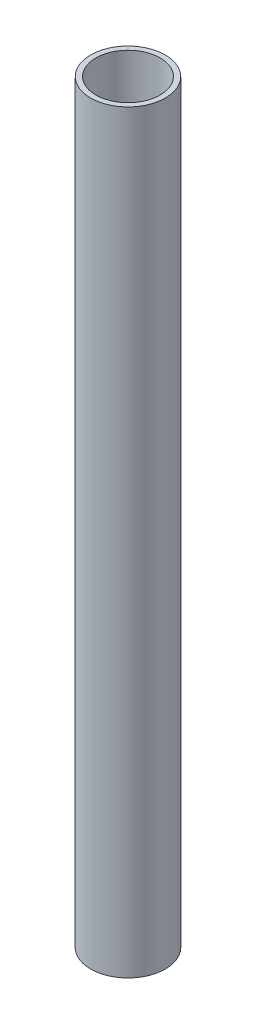
ISO-10303-21;
HEADER;
FILE_DESCRIPTION(('STEP AP214'),'2;1');
FILE_NAME('part.step','',(''),(''),'','','');
FILE_SCHEMA(('AUTOMOTIVE_DESIGN { 1 0 10303 214 1 1 1 1 }'));
ENDSEC;
DATA;
#1=APPLICATION_CONTEXT('core data for automotive mechanical design processes');
#2=APPLICATION_PROTOCOL_DEFINITION('international standard','automotive_design',2000,#1);
#3=PRODUCT_CONTEXT('',#1,'mechanical');
#4=PRODUCT('Part','Part','',(#3));
#5=PRODUCT_RELATED_PRODUCT_CATEGORY('part','',(#4));
#6=PRODUCT_DEFINITION_FORMATION('','',#4);
#7=PRODUCT_DEFINITION_CONTEXT('part definition',#1,'design');
#8=PRODUCT_DEFINITION('design','',#6,#7);
#9=PRODUCT_DEFINITION_SHAPE('','',#8);
#10=(LENGTH_UNIT() NAMED_UNIT(*) SI_UNIT(.MILLI.,.METRE.));
#11=(NAMED_UNIT(*) PLANE_ANGLE_UNIT() SI_UNIT($,.RADIAN.));
#12=(NAMED_UNIT(*) SI_UNIT($,.STERADIAN.) SOLID_ANGLE_UNIT());
#13=UNCERTAINTY_MEASURE_WITH_UNIT(LENGTH_MEASURE(1.E-05),#10,'distance_accuracy_value','');
#14=(GEOMETRIC_REPRESENTATION_CONTEXT(3) GLOBAL_UNCERTAINTY_ASSIGNED_CONTEXT((#13)) GLOBAL_UNIT_ASSIGNED_CONTEXT((#10,
#11,#12)) REPRESENTATION_CONTEXT('',''));
#15=CARTESIAN_POINT('',(0.,0.,0.));
#16=DIRECTION('',(0.,0.,1.));
#17=DIRECTION('',(1.,0.,0.));
#18=AXIS2_PLACEMENT_3D('',#15,#16,#17);
#19=CARTESIAN_POINT('',(0.,609.6,0.));
#20=DIRECTION('',(0.,1.,0.));
#21=DIRECTION('',(0.,0.,1.));
#22=AXIS2_PLACEMENT_3D('',#19,#20,#21);
#23=PLANE('',#22);
#24=CARTESIAN_POINT('',(0.,609.6,0.));
#25=DIRECTION('',(0.,1.,0.));
#26=DIRECTION('',(0.,0.,1.));
#27=AXIS2_PLACEMENT_3D('',#24,#25,#26);
#28=CIRCLE('',#27,30.1625);
#29=CARTESIAN_POINT('',(0.,609.6,30.1625));
#30=VERTEX_POINT('',#29);
#31=EDGE_CURVE('E10',#30,#30,#28,.T.);
#32=ORIENTED_EDGE('',*,*,#31,.T.);
#33=EDGE_LOOP('',(#32));
#34=FACE_BOUND('',#33,.T.);
#35=CARTESIAN_POINT('',(0.,609.6,0.));
#36=DIRECTION('',(0.,1.,0.));
#37=DIRECTION('',(0.,0.,1.));
#38=AXIS2_PLACEMENT_3D('',#35,#36,#37);
#39=CIRCLE('',#38,25.9969);
#40=CARTESIAN_POINT('',(0.,609.6,25.9969));
#41=VERTEX_POINT('',#40);
#42=EDGE_CURVE('E43',#41,#41,#39,.T.);
#43=ORIENTED_EDGE('',*,*,#42,.F.);
#44=EDGE_LOOP('',(#43));
#45=FACE_BOUND('',#44,.T.);
#46=ADVANCED_FACE('F32',(#34,#45),#23,.T.);
#47=CARTESIAN_POINT('',(0.,0.,0.));
#48=DIRECTION('',(0.,1.,0.));
#49=DIRECTION('',(0.,0.,1.));
#50=AXIS2_PLACEMENT_3D('',#47,#48,#49);
#51=PLANE('',#50);
#52=CARTESIAN_POINT('',(0.,0.,0.));
#53=DIRECTION('',(0.,1.,0.));
#54=DIRECTION('',(0.,0.,1.));
#55=AXIS2_PLACEMENT_3D('',#52,#53,#54);
#56=CIRCLE('',#55,30.1625);
#57=CARTESIAN_POINT('',(0.,0.,30.1625));
#58=VERTEX_POINT('',#57);
#59=EDGE_CURVE('E36',#58,#58,#56,.T.);
#60=ORIENTED_EDGE('',*,*,#59,.F.);
#61=EDGE_LOOP('',(#60));
#62=FACE_BOUND('',#61,.T.);
#63=CARTESIAN_POINT('',(0.,0.,0.));
#64=DIRECTION('',(0.,1.,0.));
#65=DIRECTION('',(0.,0.,1.));
#66=AXIS2_PLACEMENT_3D('',#63,#64,#65);
#67=CIRCLE('',#66,25.9969);
#68=CARTESIAN_POINT('',(0.,0.,25.9969));
#69=VERTEX_POINT('',#68);
#70=EDGE_CURVE('E45',#69,#69,#67,.T.);
#71=ORIENTED_EDGE('',*,*,#70,.T.);
#72=EDGE_LOOP('',(#71));
#73=FACE_BOUND('',#72,.T.);
#74=ADVANCED_FACE('F55',(#62,#73),#51,.F.);
#75=CARTESIAN_POINT('',(0.,609.6,0.));
#76=DIRECTION('',(0.,-1.,0.));
#77=DIRECTION('',(0.,0.,-1.));
#78=AXIS2_PLACEMENT_3D('',#75,#76,#77);
#79=CYLINDRICAL_SURFACE('',#78,30.1625);
#80=ORIENTED_EDGE('',*,*,#31,.F.);
#81=EDGE_LOOP('',(#80));
#82=FACE_BOUND('',#81,.T.);
#83=ORIENTED_EDGE('',*,*,#59,.T.);
#84=EDGE_LOOP('',(#83));
#85=FACE_BOUND('',#84,.T.);
#86=ADVANCED_FACE('F34',(#82,#85),#79,.T.);
#87=CARTESIAN_POINT('',(0.,609.6,0.));
#88=DIRECTION('',(0.,-1.,0.));
#89=DIRECTION('',(0.,0.,-1.));
#90=AXIS2_PLACEMENT_3D('',#87,#88,#89);
#91=CYLINDRICAL_SURFACE('',#90,25.9969);
#92=ORIENTED_EDGE('',*,*,#42,.T.);
#93=EDGE_LOOP('',(#92));
#94=FACE_BOUND('',#93,.T.);
#95=ORIENTED_EDGE('',*,*,#70,.F.);
#96=EDGE_LOOP('',(#95));
#97=FACE_BOUND('',#96,.T.);
#98=ADVANCED_FACE('F51',(#94,#97),#91,.F.);
#99=CLOSED_SHELL('',(#46,#74,#86,#98));
#100=MANIFOLD_SOLID_BREP('B2',#99);
#101=ADVANCED_BREP_SHAPE_REPRESENTATION('',(#18,#100),#14);
#102=SHAPE_DEFINITION_REPRESENTATION(#9,#101);
ENDSEC;
END-ISO-10303-21;
